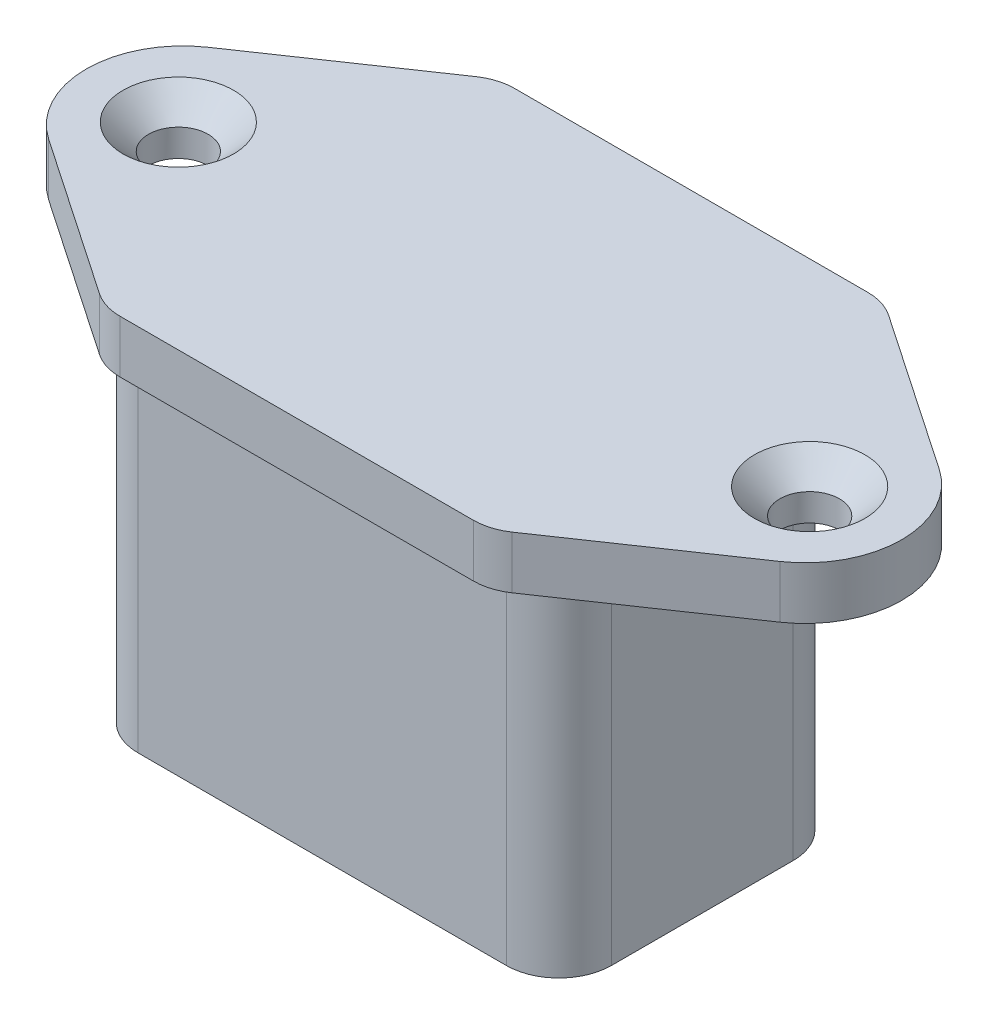
ISO-10303-21;
HEADER;
FILE_DESCRIPTION(('STEP AP214'),'2;1');
FILE_NAME('part.step','',(''),(''),'','','');
FILE_SCHEMA(('AUTOMOTIVE_DESIGN { 1 0 10303 214 1 1 1 1 }'));
ENDSEC;
DATA;
#1=APPLICATION_CONTEXT('core data for automotive mechanical design processes');
#2=APPLICATION_PROTOCOL_DEFINITION('international standard','automotive_design',2000,#1);
#3=PRODUCT_CONTEXT('',#1,'mechanical');
#4=PRODUCT('Part','Part','',(#3));
#5=PRODUCT_RELATED_PRODUCT_CATEGORY('part','',(#4));
#6=PRODUCT_DEFINITION_FORMATION('','',#4);
#7=PRODUCT_DEFINITION_CONTEXT('part definition',#1,'design');
#8=PRODUCT_DEFINITION('design','',#6,#7);
#9=PRODUCT_DEFINITION_SHAPE('','',#8);
#10=(LENGTH_UNIT() NAMED_UNIT(*) SI_UNIT(.MILLI.,.METRE.));
#11=(NAMED_UNIT(*) PLANE_ANGLE_UNIT() SI_UNIT($,.RADIAN.));
#12=(NAMED_UNIT(*) SI_UNIT($,.STERADIAN.) SOLID_ANGLE_UNIT());
#13=UNCERTAINTY_MEASURE_WITH_UNIT(LENGTH_MEASURE(1.E-05),#10,'distance_accuracy_value','');
#14=(GEOMETRIC_REPRESENTATION_CONTEXT(3) GLOBAL_UNCERTAINTY_ASSIGNED_CONTEXT((#13)) GLOBAL_UNIT_ASSIGNED_CONTEXT((#10,
#11,#12)) REPRESENTATION_CONTEXT('',''));
#15=CARTESIAN_POINT('',(0.,0.,0.));
#16=DIRECTION('',(0.,0.,1.));
#17=DIRECTION('',(1.,0.,0.));
#18=AXIS2_PLACEMENT_3D('',#15,#16,#17);
#19=CARTESIAN_POINT('',(17.75,12.75,9.8));
#20=DIRECTION('',(0.,-1.,0.));
#21=DIRECTION('',(0.,0.,-1.));
#22=AXIS2_PLACEMENT_3D('',#19,#20,#21);
#23=PLANE('',#22);
#24=DIRECTION('',(1.,0.,0.));
#25=VECTOR('',#24,1.);
#26=CARTESIAN_POINT('',(-11.,12.75,21.05));
#27=LINE('',#26,#25);
#28=CARTESIAN_POINT('',(-10.0756186418678,12.75,21.05));
#29=VERTEX_POINT('',#28);
#30=CARTESIAN_POINT('',(10.0756186418678,12.75,21.05));
#31=VERTEX_POINT('',#30);
#32=EDGE_CURVE('E418',#29,#31,#27,.T.);
#33=ORIENTED_EDGE('',*,*,#32,.T.);
#34=CARTESIAN_POINT('',(10.0756186418678,12.75,18.05));
#35=DIRECTION('',(0.,-1.,0.));
#36=DIRECTION('',(0.,0.,-1.));
#37=AXIS2_PLACEMENT_3D('',#34,#35,#36);
#38=CIRCLE('',#37,3.);
#39=CARTESIAN_POINT('',(11.76407535747,12.75,20.529740696028));
#40=VERTEX_POINT('',#39);
#41=EDGE_CURVE('E180',#31,#40,#38,.F.);
#42=ORIENTED_EDGE('',*,*,#41,.T.);
#43=DIRECTION('',(0.826580232009344,0.,-0.562818905200757));
#44=VECTOR('',#43,1.);
#45=CARTESIAN_POINT('',(11.,12.75,21.05));
#46=LINE('',#45,#44);
#47=CARTESIAN_POINT('',(20.8455039786042,12.75,14.3461912760514));
#48=VERTEX_POINT('',#47);
#49=EDGE_CURVE('E389',#40,#48,#46,.T.);
#50=ORIENTED_EDGE('',*,*,#49,.T.);
#51=CARTESIAN_POINT('',(17.75,12.75,9.8));
#52=DIRECTION('',(0.,1.,0.));
#53=DIRECTION('',(0.,0.,-1.));
#54=AXIS2_PLACEMENT_3D('',#51,#52,#53);
#55=CIRCLE('',#54,5.5);
#56=CARTESIAN_POINT('',(20.8455039786042,12.75,5.25380872394861));
#57=VERTEX_POINT('',#56);
#58=EDGE_CURVE('E393',#48,#57,#55,.T.);
#59=ORIENTED_EDGE('',*,*,#58,.T.);
#60=DIRECTION('',(-0.826580232009344,0.,-0.562818905200758));
#61=VECTOR('',#60,1.);
#62=CARTESIAN_POINT('',(11.,12.75,-1.45));
#63=LINE('',#62,#61);
#64=CARTESIAN_POINT('',(11.76407535747,12.75,-0.929740696028029));
#65=VERTEX_POINT('',#64);
#66=EDGE_CURVE('E432',#57,#65,#63,.T.);
#67=ORIENTED_EDGE('',*,*,#66,.T.);
#68=CARTESIAN_POINT('',(10.0756186418678,12.75,1.55));
#69=DIRECTION('',(0.,-1.,0.));
#70=DIRECTION('',(0.,0.,-1.));
#71=AXIS2_PLACEMENT_3D('',#68,#69,#70);
#72=CIRCLE('',#71,3.);
#73=CARTESIAN_POINT('',(10.0756186418678,12.75,-1.45));
#74=VERTEX_POINT('',#73);
#75=EDGE_CURVE('E171',#65,#74,#72,.F.);
#76=ORIENTED_EDGE('',*,*,#75,.T.);
#77=DIRECTION('',(-1.,0.,0.));
#78=VECTOR('',#77,1.);
#79=CARTESIAN_POINT('',(-11.,12.75,-1.45));
#80=LINE('',#79,#78);
#81=CARTESIAN_POINT('',(-10.0756186418678,12.75,-1.45));
#82=VERTEX_POINT('',#81);
#83=EDGE_CURVE('E429',#74,#82,#80,.T.);
#84=ORIENTED_EDGE('',*,*,#83,.T.);
#85=CARTESIAN_POINT('',(-10.0756186418678,12.75,1.55));
#86=DIRECTION('',(0.,-1.,0.));
#87=DIRECTION('',(0.,0.,-1.));
#88=AXIS2_PLACEMENT_3D('',#85,#86,#87);
#89=CIRCLE('',#88,3.);
#90=CARTESIAN_POINT('',(-11.76407535747,12.75,-0.929740696028028));
#91=VERTEX_POINT('',#90);
#92=EDGE_CURVE('E174',#82,#91,#89,.F.);
#93=ORIENTED_EDGE('',*,*,#92,.T.);
#94=DIRECTION('',(-0.826580232009344,0.,0.562818905200757));
#95=VECTOR('',#94,1.);
#96=CARTESIAN_POINT('',(-11.,12.75,-1.45));
#97=LINE('',#96,#95);
#98=CARTESIAN_POINT('',(-20.8455039786042,12.75,5.25380872394861));
#99=VERTEX_POINT('',#98);
#100=EDGE_CURVE('E426',#91,#99,#97,.T.);
#101=ORIENTED_EDGE('',*,*,#100,.T.);
#102=CARTESIAN_POINT('',(-17.75,12.75,9.8));
#103=DIRECTION('',(0.,1.,0.));
#104=DIRECTION('',(0.,0.,1.));
#105=AXIS2_PLACEMENT_3D('',#102,#103,#104);
#106=CIRCLE('',#105,5.5);
#107=CARTESIAN_POINT('',(-20.8455039786042,12.75,14.3461912760514));
#108=VERTEX_POINT('',#107);
#109=EDGE_CURVE('E423',#99,#108,#106,.T.);
#110=ORIENTED_EDGE('',*,*,#109,.T.);
#111=DIRECTION('',(0.826580232009344,0.,0.562818905200757));
#112=VECTOR('',#111,1.);
#113=CARTESIAN_POINT('',(-11.,12.75,21.05));
#114=LINE('',#113,#112);
#115=CARTESIAN_POINT('',(-11.76407535747,12.75,20.529740696028));
#116=VERTEX_POINT('',#115);
#117=EDGE_CURVE('E420',#108,#116,#114,.T.);
#118=ORIENTED_EDGE('',*,*,#117,.T.);
#119=CARTESIAN_POINT('',(-10.0756186418678,12.75,18.05));
#120=DIRECTION('',(0.,-1.,0.));
#121=DIRECTION('',(0.,0.,-1.));
#122=AXIS2_PLACEMENT_3D('',#119,#120,#121);
#123=CIRCLE('',#122,3.);
#124=EDGE_CURVE('E177',#116,#29,#123,.F.);
#125=ORIENTED_EDGE('',*,*,#124,.T.);
#126=EDGE_LOOP('',(#33,#42,#50,#59,#67,#76,#84,#93,#101,#110,#118,#125));
#127=FACE_BOUND('',#126,.T.);
#128=CARTESIAN_POINT('',(18.,12.75,9.8));
#129=DIRECTION('',(0.,1.,0.));
#130=DIRECTION('',(0.,0.,1.));
#131=AXIS2_PLACEMENT_3D('',#128,#129,#130);
#132=CIRCLE('',#131,3.15);
#133=CARTESIAN_POINT('',(18.,12.75,12.95));
#134=VERTEX_POINT('',#133);
#135=EDGE_CURVE('E442',#134,#134,#132,.T.);
#136=ORIENTED_EDGE('',*,*,#135,.F.);
#137=EDGE_LOOP('',(#136));
#138=FACE_BOUND('',#137,.T.);
#139=CARTESIAN_POINT('',(-18.,12.75,9.8));
#140=DIRECTION('',(0.,1.,0.));
#141=DIRECTION('',(0.,0.,1.));
#142=AXIS2_PLACEMENT_3D('',#139,#140,#141);
#143=CIRCLE('',#142,3.15);
#144=CARTESIAN_POINT('',(-18.,12.75,12.95));
#145=VERTEX_POINT('',#144);
#146=EDGE_CURVE('E451',#145,#145,#143,.T.);
#147=ORIENTED_EDGE('',*,*,#146,.F.);
#148=EDGE_LOOP('',(#147));
#149=FACE_BOUND('',#148,.T.);
#150=ADVANCED_FACE('F34',(#127,#138,#149),#23,.F.);
#151=CARTESIAN_POINT('',(13.5,-9.75,19.6));
#152=DIRECTION('',(-1.,0.,0.));
#153=DIRECTION('',(0.,0.,1.));
#154=AXIS2_PLACEMENT_3D('',#151,#152,#153);
#155=PLANE('',#154);
#156=DIRECTION('',(0.,0.,-1.));
#157=VECTOR('',#156,1.);
#158=CARTESIAN_POINT('',(13.5,-9.75,19.6));
#159=LINE('',#158,#157);
#160=CARTESIAN_POINT('',(13.5,-9.75,16.6));
#161=VERTEX_POINT('',#160);
#162=CARTESIAN_POINT('',(13.5,-9.75,6.24264068711929));
#163=VERTEX_POINT('',#162);
#164=EDGE_CURVE('E136',#161,#163,#159,.T.);
#165=ORIENTED_EDGE('',*,*,#164,.T.);
#166=DIRECTION('',(0.,1.,0.));
#167=VECTOR('',#166,1.);
#168=CARTESIAN_POINT('',(13.5,9.75,6.24264068711929));
#169=LINE('',#168,#167);
#170=CARTESIAN_POINT('',(13.5,9.75,6.24264068711929));
#171=VERTEX_POINT('',#170);
#172=EDGE_CURVE('E204',#163,#171,#169,.T.);
#173=ORIENTED_EDGE('',*,*,#172,.T.);
#174=DIRECTION('',(0.,0.,-1.));
#175=VECTOR('',#174,1.);
#176=CARTESIAN_POINT('',(13.5,9.75,19.6));
#177=LINE('',#176,#175);
#178=CARTESIAN_POINT('',(13.5,9.75,16.6));
#179=VERTEX_POINT('',#178);
#180=EDGE_CURVE('E138',#179,#171,#177,.T.);
#181=ORIENTED_EDGE('',*,*,#180,.F.);
#182=DIRECTION('',(0.,1.,0.));
#183=VECTOR('',#182,1.);
#184=CARTESIAN_POINT('',(13.5,-9.75,16.6));
#185=LINE('',#184,#183);
#186=EDGE_CURVE('E202',#179,#161,#185,.F.);
#187=ORIENTED_EDGE('',*,*,#186,.T.);
#188=EDGE_LOOP('',(#165,#173,#181,#187));
#189=FACE_BOUND('',#188,.T.);
#190=ADVANCED_FACE('F272',(#189),#155,.F.);
#191=CARTESIAN_POINT('',(-13.5,-9.75,19.6));
#192=DIRECTION('',(1.,0.,0.));
#193=DIRECTION('',(0.,0.,-1.));
#194=AXIS2_PLACEMENT_3D('',#191,#192,#193);
#195=PLANE('',#194);
#196=DIRECTION('',(0.,0.,-1.));
#197=VECTOR('',#196,1.);
#198=CARTESIAN_POINT('',(-13.5,9.75,19.6));
#199=LINE('',#198,#197);
#200=CARTESIAN_POINT('',(-13.5,9.75,16.6));
#201=VERTEX_POINT('',#200);
#202=CARTESIAN_POINT('',(-13.5,9.75,6.24264068711929));
#203=VERTEX_POINT('',#202);
#204=EDGE_CURVE('E130',#201,#203,#199,.T.);
#205=ORIENTED_EDGE('',*,*,#204,.T.);
#206=DIRECTION('',(0.,-1.,0.));
#207=VECTOR('',#206,1.);
#208=CARTESIAN_POINT('',(-13.5,-9.75,6.24264068711929));
#209=LINE('',#208,#207);
#210=CARTESIAN_POINT('',(-13.5,-9.75,6.24264068711929));
#211=VERTEX_POINT('',#210);
#212=EDGE_CURVE('E122',#203,#211,#209,.T.);
#213=ORIENTED_EDGE('',*,*,#212,.T.);
#214=DIRECTION('',(0.,0.,-1.));
#215=VECTOR('',#214,1.);
#216=CARTESIAN_POINT('',(-13.5,-9.75,19.6));
#217=LINE('',#216,#215);
#218=CARTESIAN_POINT('',(-13.5,-9.75,16.6));
#219=VERTEX_POINT('',#218);
#220=EDGE_CURVE('E129',#219,#211,#217,.T.);
#221=ORIENTED_EDGE('',*,*,#220,.F.);
#222=DIRECTION('',(0.,-1.,0.));
#223=VECTOR('',#222,1.);
#224=CARTESIAN_POINT('',(-13.5,-9.75,16.6));
#225=LINE('',#224,#223);
#226=EDGE_CURVE('E65',#219,#201,#225,.F.);
#227=ORIENTED_EDGE('',*,*,#226,.T.);
#228=EDGE_LOOP('',(#205,#213,#221,#227));
#229=FACE_BOUND('',#228,.T.);
#230=ADVANCED_FACE('F128',(#229),#195,.F.);
#231=CARTESIAN_POINT('',(-13.5,-9.75,19.6));
#232=DIRECTION('',(0.,1.,0.));
#233=DIRECTION('',(0.,0.,1.));
#234=AXIS2_PLACEMENT_3D('',#231,#232,#233);
#235=PLANE('',#234);
#236=DIRECTION('',(0.707106781186549,0.,0.707106781186546));
#237=VECTOR('',#236,1.);
#238=CARTESIAN_POINT('',(13.5,-9.75,5.));
#239=LINE('',#238,#237);
#240=CARTESIAN_POINT('',(9.37867965644034,-9.75,0.878679656440353));
#241=VERTEX_POINT('',#240);
#242=CARTESIAN_POINT('',(12.6213203435596,-9.75,4.12132034355964));
#243=VERTEX_POINT('',#242);
#244=EDGE_CURVE('E154',#241,#243,#239,.T.);
#245=ORIENTED_EDGE('',*,*,#244,.T.);
#246=CARTESIAN_POINT('',(10.5,-9.75,6.24264068711929));
#247=DIRECTION('',(0.,1.,0.));
#248=DIRECTION('',(0.,0.,1.));
#249=AXIS2_PLACEMENT_3D('',#246,#247,#248);
#250=CIRCLE('',#249,3.);
#251=EDGE_CURVE('E218',#243,#163,#250,.F.);
#252=ORIENTED_EDGE('',*,*,#251,.T.);
#253=ORIENTED_EDGE('',*,*,#164,.F.);
#254=CARTESIAN_POINT('',(10.5,-9.75,16.6));
#255=DIRECTION('',(0.,1.,0.));
#256=DIRECTION('',(0.,0.,1.));
#257=AXIS2_PLACEMENT_3D('',#254,#255,#256);
#258=CIRCLE('',#257,3.);
#259=CARTESIAN_POINT('',(10.5,-9.75,19.6));
#260=VERTEX_POINT('',#259);
#261=EDGE_CURVE('E212',#161,#260,#258,.F.);
#262=ORIENTED_EDGE('',*,*,#261,.T.);
#263=DIRECTION('',(1.,0.,0.));
#264=VECTOR('',#263,1.);
#265=CARTESIAN_POINT('',(-13.5,-9.75,19.6));
#266=LINE('',#265,#264);
#267=CARTESIAN_POINT('',(-10.5,-9.75,19.6));
#268=VERTEX_POINT('',#267);
#269=EDGE_CURVE('E141',#268,#260,#266,.T.);
#270=ORIENTED_EDGE('',*,*,#269,.F.);
#271=CARTESIAN_POINT('',(-10.5,-9.75,16.6));
#272=DIRECTION('',(0.,1.,0.));
#273=DIRECTION('',(0.,0.,1.));
#274=AXIS2_PLACEMENT_3D('',#271,#272,#273);
#275=CIRCLE('',#274,3.);
#276=EDGE_CURVE('E126',#268,#219,#275,.F.);
#277=ORIENTED_EDGE('',*,*,#276,.T.);
#278=ORIENTED_EDGE('',*,*,#220,.T.);
#279=CARTESIAN_POINT('',(-10.5,-9.75,6.24264068711929));
#280=DIRECTION('',(0.,1.,0.));
#281=DIRECTION('',(0.,0.,1.));
#282=AXIS2_PLACEMENT_3D('',#279,#280,#281);
#283=CIRCLE('',#282,3.);
#284=CARTESIAN_POINT('',(-12.6213203435596,-9.75,4.12132034355964));
#285=VERTEX_POINT('',#284);
#286=EDGE_CURVE('E118',#211,#285,#283,.F.);
#287=ORIENTED_EDGE('',*,*,#286,.T.);
#288=DIRECTION('',(0.707106781186549,0.,-0.707106781186546));
#289=VECTOR('',#288,1.);
#290=CARTESIAN_POINT('',(-13.5,-9.75,5.));
#291=LINE('',#290,#289);
#292=CARTESIAN_POINT('',(-9.37867965644034,-9.75,0.878679656440353));
#293=VERTEX_POINT('',#292);
#294=EDGE_CURVE('E152',#285,#293,#291,.T.);
#295=ORIENTED_EDGE('',*,*,#294,.T.);
#296=CARTESIAN_POINT('',(-7.2573593128807,-9.75,3.));
#297=DIRECTION('',(0.,1.,0.));
#298=DIRECTION('',(0.,0.,1.));
#299=AXIS2_PLACEMENT_3D('',#296,#297,#298);
#300=CIRCLE('',#299,3.);
#301=CARTESIAN_POINT('',(-7.2573593128807,-9.75,0.));
#302=VERTEX_POINT('',#301);
#303=EDGE_CURVE('E125',#293,#302,#300,.F.);
#304=ORIENTED_EDGE('',*,*,#303,.T.);
#305=DIRECTION('',(1.,0.,0.));
#306=VECTOR('',#305,1.);
#307=CARTESIAN_POINT('',(-13.5,-9.75,0.));
#308=LINE('',#307,#306);
#309=CARTESIAN_POINT('',(7.2573593128807,-9.75,0.));
#310=VERTEX_POINT('',#309);
#311=EDGE_CURVE('E259',#302,#310,#308,.T.);
#312=ORIENTED_EDGE('',*,*,#311,.T.);
#313=CARTESIAN_POINT('',(7.2573593128807,-9.75,3.));
#314=DIRECTION('',(0.,1.,0.));
#315=DIRECTION('',(0.,0.,1.));
#316=AXIS2_PLACEMENT_3D('',#313,#314,#315);
#317=CIRCLE('',#316,3.);
#318=EDGE_CURVE('E216',#310,#241,#317,.F.);
#319=ORIENTED_EDGE('',*,*,#318,.T.);
#320=EDGE_LOOP('',(#245,#252,#253,#262,#270,#277,#278,#287,#295,#304,#312,#319));
#321=FACE_BOUND('',#320,.T.);
#322=ADVANCED_FACE('F134',(#321),#235,.F.);
#323=CARTESIAN_POINT('',(0.,0.,19.6));
#324=DIRECTION('',(0.,0.,-1.));
#325=DIRECTION('',(-1.,0.,0.));
#326=AXIS2_PLACEMENT_3D('',#323,#324,#325);
#327=PLANE('',#326);
#328=DIRECTION('',(-1.,0.,0.));
#329=VECTOR('',#328,1.);
#330=CARTESIAN_POINT('',(-13.5,9.75,19.6));
#331=LINE('',#330,#329);
#332=CARTESIAN_POINT('',(10.5,9.75,19.6));
#333=VERTEX_POINT('',#332);
#334=CARTESIAN_POINT('',(-10.5,9.75,19.6));
#335=VERTEX_POINT('',#334);
#336=EDGE_CURVE('E250',#333,#335,#331,.T.);
#337=ORIENTED_EDGE('',*,*,#336,.T.);
#338=DIRECTION('',(0.,-1.,0.));
#339=VECTOR('',#338,1.);
#340=CARTESIAN_POINT('',(-10.5,0.,19.6));
#341=LINE('',#340,#339);
#342=EDGE_CURVE('E231',#335,#268,#341,.T.);
#343=ORIENTED_EDGE('',*,*,#342,.T.);
#344=ORIENTED_EDGE('',*,*,#269,.T.);
#345=DIRECTION('',(0.,1.,0.));
#346=VECTOR('',#345,1.);
#347=CARTESIAN_POINT('',(10.5,0.,19.6));
#348=LINE('',#347,#346);
#349=EDGE_CURVE('E131',#260,#333,#348,.T.);
#350=ORIENTED_EDGE('',*,*,#349,.T.);
#351=EDGE_LOOP('',(#337,#343,#344,#350));
#352=FACE_BOUND('',#351,.T.);
#353=ADVANCED_FACE('F256',(#352),#327,.F.);
#354=CARTESIAN_POINT('',(0.,0.,0.));
#355=DIRECTION('',(0.,0.,-1.));
#356=DIRECTION('',(-1.,0.,0.));
#357=AXIS2_PLACEMENT_3D('',#354,#355,#356);
#358=PLANE('',#357);
#359=DIRECTION('',(-1.,0.,0.));
#360=VECTOR('',#359,1.);
#361=CARTESIAN_POINT('',(-13.5,9.75,0.));
#362=LINE('',#361,#360);
#363=CARTESIAN_POINT('',(7.2573593128807,9.75,0.));
#364=VERTEX_POINT('',#363);
#365=CARTESIAN_POINT('',(-7.2573593128807,9.75,0.));
#366=VERTEX_POINT('',#365);
#367=EDGE_CURVE('E373',#364,#366,#362,.T.);
#368=ORIENTED_EDGE('',*,*,#367,.F.);
#369=DIRECTION('',(0.,-1.,0.));
#370=VECTOR('',#369,1.);
#371=CARTESIAN_POINT('',(7.2573593128807,0.,0.));
#372=LINE('',#371,#370);
#373=EDGE_CURVE('E223',#364,#310,#372,.T.);
#374=ORIENTED_EDGE('',*,*,#373,.T.);
#375=ORIENTED_EDGE('',*,*,#311,.F.);
#376=DIRECTION('',(0.,1.,0.));
#377=VECTOR('',#376,1.);
#378=CARTESIAN_POINT('',(-7.2573593128807,0.,0.));
#379=LINE('',#378,#377);
#380=EDGE_CURVE('E220',#302,#366,#379,.T.);
#381=ORIENTED_EDGE('',*,*,#380,.T.);
#382=EDGE_LOOP('',(#368,#374,#375,#381));
#383=FACE_BOUND('',#382,.T.);
#384=ADVANCED_FACE('F324',(#383),#358,.T.);
#385=CARTESIAN_POINT('',(13.5,-9.75,5.));
#386=DIRECTION('',(0.707106781186546,0.,-0.707106781186549));
#387=DIRECTION('',(0.,-1.,0.));
#388=AXIS2_PLACEMENT_3D('',#385,#386,#387);
#389=PLANE('',#388);
#390=DIRECTION('',(-0.707106781186549,0.,-0.707106781186546));
#391=VECTOR('',#390,1.);
#392=CARTESIAN_POINT('',(13.5,9.75,5.));
#393=LINE('',#392,#391);
#394=CARTESIAN_POINT('',(12.6213203435596,9.75,4.12132034355964));
#395=VERTEX_POINT('',#394);
#396=CARTESIAN_POINT('',(9.37867965644034,9.75,0.878679656440353));
#397=VERTEX_POINT('',#396);
#398=EDGE_CURVE('E149',#395,#397,#393,.T.);
#399=ORIENTED_EDGE('',*,*,#398,.F.);
#400=DIRECTION('',(0.,1.,0.));
#401=VECTOR('',#400,1.);
#402=CARTESIAN_POINT('',(12.6213203435596,-9.75,4.12132034355964));
#403=LINE('',#402,#401);
#404=EDGE_CURVE('E210',#395,#243,#403,.F.);
#405=ORIENTED_EDGE('',*,*,#404,.T.);
#406=ORIENTED_EDGE('',*,*,#244,.F.);
#407=DIRECTION('',(0.,-1.,0.));
#408=VECTOR('',#407,1.);
#409=CARTESIAN_POINT('',(9.37867965644034,-9.75,0.878679656440354));
#410=LINE('',#409,#408);
#411=EDGE_CURVE('E207',#241,#397,#410,.F.);
#412=ORIENTED_EDGE('',*,*,#411,.T.);
#413=EDGE_LOOP('',(#399,#405,#406,#412));
#414=FACE_BOUND('',#413,.T.);
#415=ADVANCED_FACE('F327',(#414),#389,.T.);
#416=CARTESIAN_POINT('',(-13.5,-9.75,5.));
#417=DIRECTION('',(-0.707106781186546,0.,-0.707106781186549));
#418=DIRECTION('',(0.,1.,0.));
#419=AXIS2_PLACEMENT_3D('',#416,#417,#418);
#420=PLANE('',#419);
#421=DIRECTION('',(-0.707106781186549,0.,0.707106781186546));
#422=VECTOR('',#421,1.);
#423=CARTESIAN_POINT('',(-13.5,9.75,5.));
#424=LINE('',#423,#422);
#425=CARTESIAN_POINT('',(-9.37867965644034,9.75,0.878679656440353));
#426=VERTEX_POINT('',#425);
#427=CARTESIAN_POINT('',(-12.6213203435596,9.75,4.12132034355964));
#428=VERTEX_POINT('',#427);
#429=EDGE_CURVE('E147',#426,#428,#424,.T.);
#430=ORIENTED_EDGE('',*,*,#429,.F.);
#431=DIRECTION('',(0.,1.,0.));
#432=VECTOR('',#431,1.);
#433=CARTESIAN_POINT('',(-9.37867965644034,-9.75,0.878679656440354));
#434=LINE('',#433,#432);
#435=EDGE_CURVE('E51',#426,#293,#434,.F.);
#436=ORIENTED_EDGE('',*,*,#435,.T.);
#437=ORIENTED_EDGE('',*,*,#294,.F.);
#438=DIRECTION('',(0.,-1.,0.));
#439=VECTOR('',#438,1.);
#440=CARTESIAN_POINT('',(-12.6213203435596,9.75,4.12132034355964));
#441=LINE('',#440,#439);
#442=EDGE_CURVE('E74',#285,#428,#441,.F.);
#443=ORIENTED_EDGE('',*,*,#442,.T.);
#444=EDGE_LOOP('',(#430,#436,#437,#443));
#445=FACE_BOUND('',#444,.T.);
#446=ADVANCED_FACE('F320',(#445),#420,.T.);
#447=CARTESIAN_POINT('',(17.75,12.75,9.8));
#448=DIRECTION('',(0.,-1.,0.));
#449=DIRECTION('',(0.,0.,-1.));
#450=AXIS2_PLACEMENT_3D('',#447,#448,#449);
#451=CYLINDRICAL_SURFACE('',#450,5.5);
#452=CARTESIAN_POINT('',(17.75,9.75,9.8));
#453=DIRECTION('',(0.,1.,0.));
#454=DIRECTION('',(0.,0.,-1.));
#455=AXIS2_PLACEMENT_3D('',#452,#453,#454);
#456=CIRCLE('',#455,5.5);
#457=CARTESIAN_POINT('',(20.8455039786042,9.75,14.3461912760514));
#458=VERTEX_POINT('',#457);
#459=CARTESIAN_POINT('',(20.8455039786042,9.75,5.25380872394861));
#460=VERTEX_POINT('',#459);
#461=EDGE_CURVE('E412',#458,#460,#456,.T.);
#462=ORIENTED_EDGE('',*,*,#461,.T.);
#463=DIRECTION('',(0.,-1.,0.));
#464=VECTOR('',#463,1.);
#465=CARTESIAN_POINT('',(20.8455039786042,12.75,5.25380872394861));
#466=LINE('',#465,#464);
#467=EDGE_CURVE('E374',#57,#460,#466,.T.);
#468=ORIENTED_EDGE('',*,*,#467,.F.);
#469=ORIENTED_EDGE('',*,*,#58,.F.);
#470=DIRECTION('',(0.,-1.,0.));
#471=VECTOR('',#470,1.);
#472=CARTESIAN_POINT('',(20.8455039786042,12.75,14.3461912760514));
#473=LINE('',#472,#471);
#474=EDGE_CURVE('E386',#48,#458,#473,.T.);
#475=ORIENTED_EDGE('',*,*,#474,.T.);
#476=EDGE_LOOP('',(#462,#468,#469,#475));
#477=FACE_BOUND('',#476,.T.);
#478=ADVANCED_FACE('F316',(#477),#451,.T.);
#479=CARTESIAN_POINT('',(11.,12.75,-1.45));
#480=DIRECTION('',(-0.562818905200757,0.,0.826580232009344));
#481=DIRECTION('',(0.826580232009344,0.,0.562818905200758));
#482=AXIS2_PLACEMENT_3D('',#479,#480,#481);
#483=PLANE('',#482);
#484=DIRECTION('',(-0.826580232009344,0.,-0.562818905200758));
#485=VECTOR('',#484,1.);
#486=CARTESIAN_POINT('',(11.,9.75,-1.45));
#487=LINE('',#486,#485);
#488=CARTESIAN_POINT('',(11.76407535747,9.75,-0.929740696028029));
#489=VERTEX_POINT('',#488);
#490=EDGE_CURVE('E409',#460,#489,#487,.T.);
#491=ORIENTED_EDGE('',*,*,#490,.T.);
#492=DIRECTION('',(0.,-1.,0.));
#493=VECTOR('',#492,1.);
#494=CARTESIAN_POINT('',(11.76407535747,12.75,-0.929740696028029));
#495=LINE('',#494,#493);
#496=EDGE_CURVE('E199',#489,#65,#495,.F.);
#497=ORIENTED_EDGE('',*,*,#496,.T.);
#498=ORIENTED_EDGE('',*,*,#66,.F.);
#499=ORIENTED_EDGE('',*,*,#467,.T.);
#500=EDGE_LOOP('',(#491,#497,#498,#499));
#501=FACE_BOUND('',#500,.T.);
#502=ADVANCED_FACE('F312',(#501),#483,.F.);
#503=CARTESIAN_POINT('',(-11.,12.75,-1.45));
#504=DIRECTION('',(0.,0.,1.));
#505=DIRECTION('',(1.,0.,0.));
#506=AXIS2_PLACEMENT_3D('',#503,#504,#505);
#507=PLANE('',#506);
#508=DIRECTION('',(-1.,0.,0.));
#509=VECTOR('',#508,1.);
#510=CARTESIAN_POINT('',(-11.,9.75,-1.45));
#511=LINE('',#510,#509);
#512=CARTESIAN_POINT('',(10.0756186418678,9.75,-1.45));
#513=VERTEX_POINT('',#512);
#514=CARTESIAN_POINT('',(-10.0756186418678,9.75,-1.45));
#515=VERTEX_POINT('',#514);
#516=EDGE_CURVE('E406',#513,#515,#511,.T.);
#517=ORIENTED_EDGE('',*,*,#516,.T.);
#518=DIRECTION('',(0.,-1.,0.));
#519=VECTOR('',#518,1.);
#520=CARTESIAN_POINT('',(-10.0756186418678,12.75,-1.45));
#521=LINE('',#520,#519);
#522=EDGE_CURVE('E196',#515,#82,#521,.F.);
#523=ORIENTED_EDGE('',*,*,#522,.T.);
#524=ORIENTED_EDGE('',*,*,#83,.F.);
#525=DIRECTION('',(0.,-1.,0.));
#526=VECTOR('',#525,1.);
#527=CARTESIAN_POINT('',(10.0756186418678,12.75,-1.45));
#528=LINE('',#527,#526);
#529=EDGE_CURVE('E193',#74,#513,#528,.T.);
#530=ORIENTED_EDGE('',*,*,#529,.T.);
#531=EDGE_LOOP('',(#517,#523,#524,#530));
#532=FACE_BOUND('',#531,.T.);
#533=ADVANCED_FACE('F308',(#532),#507,.F.);
#534=CARTESIAN_POINT('',(-11.,12.75,-1.45));
#535=DIRECTION('',(0.562818905200757,0.,0.826580232009344));
#536=DIRECTION('',(0.826580232009344,0.,-0.562818905200757));
#537=AXIS2_PLACEMENT_3D('',#534,#535,#536);
#538=PLANE('',#537);
#539=ORIENTED_EDGE('',*,*,#100,.F.);
#540=DIRECTION('',(0.,-1.,0.));
#541=VECTOR('',#540,1.);
#542=CARTESIAN_POINT('',(-11.76407535747,12.75,-0.929740696028028));
#543=LINE('',#542,#541);
#544=CARTESIAN_POINT('',(-11.76407535747,9.75,-0.929740696028028));
#545=VERTEX_POINT('',#544);
#546=EDGE_CURVE('E186',#91,#545,#543,.T.);
#547=ORIENTED_EDGE('',*,*,#546,.T.);
#548=DIRECTION('',(-0.826580232009344,0.,0.562818905200757));
#549=VECTOR('',#548,1.);
#550=CARTESIAN_POINT('',(-11.,9.75,-1.45));
#551=LINE('',#550,#549);
#552=CARTESIAN_POINT('',(-20.8455039786042,9.75,5.25380872394861));
#553=VERTEX_POINT('',#552);
#554=EDGE_CURVE('E403',#545,#553,#551,.T.);
#555=ORIENTED_EDGE('',*,*,#554,.T.);
#556=DIRECTION('',(0.,-1.,0.));
#557=VECTOR('',#556,1.);
#558=CARTESIAN_POINT('',(-20.8455039786042,12.75,5.25380872394861));
#559=LINE('',#558,#557);
#560=EDGE_CURVE('E380',#99,#553,#559,.T.);
#561=ORIENTED_EDGE('',*,*,#560,.F.);
#562=EDGE_LOOP('',(#539,#547,#555,#561));
#563=FACE_BOUND('',#562,.T.);
#564=ADVANCED_FACE('F304',(#563),#538,.F.);
#565=CARTESIAN_POINT('',(-17.75,12.75,9.8));
#566=DIRECTION('',(0.,-1.,0.));
#567=DIRECTION('',(0.,0.,-1.));
#568=AXIS2_PLACEMENT_3D('',#565,#566,#567);
#569=CYLINDRICAL_SURFACE('',#568,5.5);
#570=CARTESIAN_POINT('',(-17.75,9.75,9.8));
#571=DIRECTION('',(0.,1.,0.));
#572=DIRECTION('',(0.,0.,1.));
#573=AXIS2_PLACEMENT_3D('',#570,#571,#572);
#574=CIRCLE('',#573,5.5);
#575=CARTESIAN_POINT('',(-20.8455039786042,9.75,14.3461912760514));
#576=VERTEX_POINT('',#575);
#577=EDGE_CURVE('E400',#553,#576,#574,.T.);
#578=ORIENTED_EDGE('',*,*,#577,.T.);
#579=DIRECTION('',(0.,-1.,0.));
#580=VECTOR('',#579,1.);
#581=CARTESIAN_POINT('',(-20.8455039786042,12.75,14.3461912760514));
#582=LINE('',#581,#580);
#583=EDGE_CURVE('E383',#108,#576,#582,.T.);
#584=ORIENTED_EDGE('',*,*,#583,.F.);
#585=ORIENTED_EDGE('',*,*,#109,.F.);
#586=ORIENTED_EDGE('',*,*,#560,.T.);
#587=EDGE_LOOP('',(#578,#584,#585,#586));
#588=FACE_BOUND('',#587,.T.);
#589=ADVANCED_FACE('F300',(#588),#569,.T.);
#590=CARTESIAN_POINT('',(-11.,12.75,21.05));
#591=DIRECTION('',(0.562818905200757,0.,-0.826580232009344));
#592=DIRECTION('',(-0.826580232009344,0.,-0.562818905200757));
#593=AXIS2_PLACEMENT_3D('',#590,#591,#592);
#594=PLANE('',#593);
#595=DIRECTION('',(0.826580232009344,0.,0.562818905200757));
#596=VECTOR('',#595,1.);
#597=CARTESIAN_POINT('',(-11.,9.75,21.05));
#598=LINE('',#597,#596);
#599=CARTESIAN_POINT('',(-11.76407535747,9.75,20.529740696028));
#600=VERTEX_POINT('',#599);
#601=EDGE_CURVE('E397',#576,#600,#598,.T.);
#602=ORIENTED_EDGE('',*,*,#601,.T.);
#603=DIRECTION('',(0.,-1.,0.));
#604=VECTOR('',#603,1.);
#605=CARTESIAN_POINT('',(-11.76407535747,12.75,20.529740696028));
#606=LINE('',#605,#604);
#607=EDGE_CURVE('E183',#600,#116,#606,.F.);
#608=ORIENTED_EDGE('',*,*,#607,.T.);
#609=ORIENTED_EDGE('',*,*,#117,.F.);
#610=ORIENTED_EDGE('',*,*,#583,.T.);
#611=EDGE_LOOP('',(#602,#608,#609,#610));
#612=FACE_BOUND('',#611,.T.);
#613=ADVANCED_FACE('F296',(#612),#594,.F.);
#614=CARTESIAN_POINT('',(-11.,12.75,21.05));
#615=DIRECTION('',(0.,0.,-1.));
#616=DIRECTION('',(-1.,0.,0.));
#617=AXIS2_PLACEMENT_3D('',#614,#615,#616);
#618=PLANE('',#617);
#619=DIRECTION('',(1.,0.,0.));
#620=VECTOR('',#619,1.);
#621=CARTESIAN_POINT('',(-11.,9.75,21.05));
#622=LINE('',#621,#620);
#623=CARTESIAN_POINT('',(-10.0756186418678,9.75,21.05));
#624=VERTEX_POINT('',#623);
#625=CARTESIAN_POINT('',(10.0756186418678,9.75,21.05));
#626=VERTEX_POINT('',#625);
#627=EDGE_CURVE('E394',#624,#626,#622,.T.);
#628=ORIENTED_EDGE('',*,*,#627,.T.);
#629=DIRECTION('',(0.,-1.,0.));
#630=VECTOR('',#629,1.);
#631=CARTESIAN_POINT('',(10.0756186418678,12.75,21.05));
#632=LINE('',#631,#630);
#633=EDGE_CURVE('E168',#626,#31,#632,.F.);
#634=ORIENTED_EDGE('',*,*,#633,.T.);
#635=ORIENTED_EDGE('',*,*,#32,.F.);
#636=DIRECTION('',(0.,-1.,0.));
#637=VECTOR('',#636,1.);
#638=CARTESIAN_POINT('',(-10.0756186418678,12.75,21.05));
#639=LINE('',#638,#637);
#640=EDGE_CURVE('E165',#29,#624,#639,.T.);
#641=ORIENTED_EDGE('',*,*,#640,.T.);
#642=EDGE_LOOP('',(#628,#634,#635,#641));
#643=FACE_BOUND('',#642,.T.);
#644=ADVANCED_FACE('F292',(#643),#618,.F.);
#645=CARTESIAN_POINT('',(11.,12.75,21.05));
#646=DIRECTION('',(-0.562818905200757,0.,-0.826580232009344));
#647=DIRECTION('',(-0.826580232009344,0.,0.562818905200757));
#648=AXIS2_PLACEMENT_3D('',#645,#646,#647);
#649=PLANE('',#648);
#650=ORIENTED_EDGE('',*,*,#49,.F.);
#651=DIRECTION('',(0.,-1.,0.));
#652=VECTOR('',#651,1.);
#653=CARTESIAN_POINT('',(11.76407535747,12.75,20.529740696028));
#654=LINE('',#653,#652);
#655=CARTESIAN_POINT('',(11.76407535747,9.75,20.529740696028));
#656=VERTEX_POINT('',#655);
#657=EDGE_CURVE('E156',#40,#656,#654,.T.);
#658=ORIENTED_EDGE('',*,*,#657,.T.);
#659=DIRECTION('',(0.826580232009344,0.,-0.562818905200757));
#660=VECTOR('',#659,1.);
#661=CARTESIAN_POINT('',(11.,9.75,21.05));
#662=LINE('',#661,#660);
#663=EDGE_CURVE('E390',#656,#458,#662,.T.);
#664=ORIENTED_EDGE('',*,*,#663,.T.);
#665=ORIENTED_EDGE('',*,*,#474,.F.);
#666=EDGE_LOOP('',(#650,#658,#664,#665));
#667=FACE_BOUND('',#666,.T.);
#668=ADVANCED_FACE('F288',(#667),#649,.F.);
#669=CARTESIAN_POINT('',(17.75,9.75,9.8));
#670=DIRECTION('',(0.,-1.,0.));
#671=DIRECTION('',(0.,0.,-1.));
#672=AXIS2_PLACEMENT_3D('',#669,#670,#671);
#673=PLANE('',#672);
#674=CARTESIAN_POINT('',(-18.,9.75,9.8));
#675=DIRECTION('',(0.,-1.,0.));
#676=DIRECTION('',(0.,0.,-1.));
#677=AXIS2_PLACEMENT_3D('',#674,#675,#676);
#678=CIRCLE('',#677,1.7);
#679=CARTESIAN_POINT('',(-18.,9.75,8.1));
#680=VERTEX_POINT('',#679);
#681=EDGE_CURVE('E445',#680,#680,#678,.T.);
#682=ORIENTED_EDGE('',*,*,#681,.F.);
#683=EDGE_LOOP('',(#682));
#684=FACE_BOUND('',#683,.T.);
#685=CARTESIAN_POINT('',(18.,9.75,9.8));
#686=DIRECTION('',(0.,-1.,0.));
#687=DIRECTION('',(0.,0.,-1.));
#688=AXIS2_PLACEMENT_3D('',#685,#686,#687);
#689=CIRCLE('',#688,1.7);
#690=CARTESIAN_POINT('',(18.,9.75,8.1));
#691=VERTEX_POINT('',#690);
#692=EDGE_CURVE('E415',#691,#691,#689,.T.);
#693=ORIENTED_EDGE('',*,*,#692,.F.);
#694=EDGE_LOOP('',(#693));
#695=FACE_BOUND('',#694,.T.);
#696=ORIENTED_EDGE('',*,*,#663,.F.);
#697=CARTESIAN_POINT('',(10.0756186418678,9.75,18.05));
#698=DIRECTION('',(0.,-1.,0.));
#699=DIRECTION('',(0.,0.,-1.));
#700=AXIS2_PLACEMENT_3D('',#697,#698,#699);
#701=CIRCLE('',#700,3.);
#702=EDGE_CURVE('E162',#656,#626,#701,.T.);
#703=ORIENTED_EDGE('',*,*,#702,.T.);
#704=ORIENTED_EDGE('',*,*,#627,.F.);
#705=CARTESIAN_POINT('',(-10.0756186418678,9.75,18.05));
#706=DIRECTION('',(0.,-1.,0.));
#707=DIRECTION('',(0.,0.,-1.));
#708=AXIS2_PLACEMENT_3D('',#705,#706,#707);
#709=CIRCLE('',#708,3.);
#710=EDGE_CURVE('E159',#624,#600,#709,.T.);
#711=ORIENTED_EDGE('',*,*,#710,.T.);
#712=ORIENTED_EDGE('',*,*,#601,.F.);
#713=ORIENTED_EDGE('',*,*,#577,.F.);
#714=ORIENTED_EDGE('',*,*,#554,.F.);
#715=CARTESIAN_POINT('',(-10.0756186418678,9.75,1.55));
#716=DIRECTION('',(0.,-1.,0.));
#717=DIRECTION('',(0.,0.,-1.));
#718=AXIS2_PLACEMENT_3D('',#715,#716,#717);
#719=CIRCLE('',#718,3.);
#720=EDGE_CURVE('E191',#545,#515,#719,.T.);
#721=ORIENTED_EDGE('',*,*,#720,.T.);
#722=ORIENTED_EDGE('',*,*,#516,.F.);
#723=CARTESIAN_POINT('',(10.0756186418678,9.75,1.55));
#724=DIRECTION('',(0.,-1.,0.));
#725=DIRECTION('',(0.,0.,-1.));
#726=AXIS2_PLACEMENT_3D('',#723,#724,#725);
#727=CIRCLE('',#726,3.);
#728=EDGE_CURVE('E189',#513,#489,#727,.T.);
#729=ORIENTED_EDGE('',*,*,#728,.T.);
#730=ORIENTED_EDGE('',*,*,#490,.F.);
#731=ORIENTED_EDGE('',*,*,#461,.F.);
#732=EDGE_LOOP('',(#696,#703,#704,#711,#712,#713,#714,#721,#722,#729,#730,#731));
#733=FACE_BOUND('',#732,.T.);
#734=ORIENTED_EDGE('',*,*,#336,.F.);
#735=CARTESIAN_POINT('',(10.5,9.75,16.6));
#736=DIRECTION('',(0.,-1.,0.));
#737=DIRECTION('',(0.,0.,-1.));
#738=AXIS2_PLACEMENT_3D('',#735,#736,#737);
#739=CIRCLE('',#738,3.);
#740=EDGE_CURVE('E11',#333,#179,#739,.F.);
#741=ORIENTED_EDGE('',*,*,#740,.T.);
#742=ORIENTED_EDGE('',*,*,#180,.T.);
#743=CARTESIAN_POINT('',(10.5,9.75,6.24264068711929));
#744=DIRECTION('',(0.,-1.,0.));
#745=DIRECTION('',(0.,0.,-1.));
#746=AXIS2_PLACEMENT_3D('',#743,#744,#745);
#747=CIRCLE('',#746,3.);
#748=EDGE_CURVE('E234',#171,#395,#747,.F.);
#749=ORIENTED_EDGE('',*,*,#748,.T.);
#750=ORIENTED_EDGE('',*,*,#398,.T.);
#751=CARTESIAN_POINT('',(7.2573593128807,9.75,3.));
#752=DIRECTION('',(0.,-1.,0.));
#753=DIRECTION('',(0.,0.,-1.));
#754=AXIS2_PLACEMENT_3D('',#751,#752,#753);
#755=CIRCLE('',#754,3.);
#756=EDGE_CURVE('E237',#397,#364,#755,.F.);
#757=ORIENTED_EDGE('',*,*,#756,.T.);
#758=ORIENTED_EDGE('',*,*,#367,.T.);
#759=CARTESIAN_POINT('',(-7.2573593128807,9.75,3.));
#760=DIRECTION('',(0.,-1.,0.));
#761=DIRECTION('',(0.,0.,-1.));
#762=AXIS2_PLACEMENT_3D('',#759,#760,#761);
#763=CIRCLE('',#762,3.);
#764=EDGE_CURVE('E240',#366,#426,#763,.F.);
#765=ORIENTED_EDGE('',*,*,#764,.T.);
#766=ORIENTED_EDGE('',*,*,#429,.T.);
#767=CARTESIAN_POINT('',(-10.5,9.75,6.24264068711929));
#768=DIRECTION('',(0.,-1.,0.));
#769=DIRECTION('',(0.,0.,-1.));
#770=AXIS2_PLACEMENT_3D('',#767,#768,#769);
#771=CIRCLE('',#770,3.);
#772=EDGE_CURVE('E242',#428,#203,#771,.F.);
#773=ORIENTED_EDGE('',*,*,#772,.T.);
#774=ORIENTED_EDGE('',*,*,#204,.F.);
#775=CARTESIAN_POINT('',(-10.5,9.75,16.6));
#776=DIRECTION('',(0.,-1.,0.));
#777=DIRECTION('',(0.,0.,-1.));
#778=AXIS2_PLACEMENT_3D('',#775,#776,#777);
#779=CIRCLE('',#778,3.);
#780=EDGE_CURVE('E43',#201,#335,#779,.F.);
#781=ORIENTED_EDGE('',*,*,#780,.T.);
#782=EDGE_LOOP('',(#734,#741,#742,#749,#750,#757,#758,#765,#766,#773,#774,#781));
#783=FACE_BOUND('',#782,.T.);
#784=ADVANCED_FACE('F249',(#684,#695,#733,#783),#673,.T.);
#785=CARTESIAN_POINT('',(10.0756186418678,12.75,18.05));
#786=DIRECTION('',(0.,-1.,0.));
#787=DIRECTION('',(0.,0.,-1.));
#788=AXIS2_PLACEMENT_3D('',#785,#786,#787);
#789=CYLINDRICAL_SURFACE('',#788,3.);
#790=ORIENTED_EDGE('',*,*,#41,.F.);
#791=ORIENTED_EDGE('',*,*,#633,.F.);
#792=ORIENTED_EDGE('',*,*,#702,.F.);
#793=ORIENTED_EDGE('',*,*,#657,.F.);
#794=EDGE_LOOP('',(#790,#791,#792,#793));
#795=FACE_BOUND('',#794,.T.);
#796=ADVANCED_FACE('F287',(#795),#789,.T.);
#797=CARTESIAN_POINT('',(-10.0756186418678,12.75,18.05));
#798=DIRECTION('',(0.,-1.,0.));
#799=DIRECTION('',(0.,0.,-1.));
#800=AXIS2_PLACEMENT_3D('',#797,#798,#799);
#801=CYLINDRICAL_SURFACE('',#800,3.);
#802=ORIENTED_EDGE('',*,*,#124,.F.);
#803=ORIENTED_EDGE('',*,*,#607,.F.);
#804=ORIENTED_EDGE('',*,*,#710,.F.);
#805=ORIENTED_EDGE('',*,*,#640,.F.);
#806=EDGE_LOOP('',(#802,#803,#804,#805));
#807=FACE_BOUND('',#806,.T.);
#808=ADVANCED_FACE('F340',(#807),#801,.T.);
#809=CARTESIAN_POINT('',(-10.0756186418678,12.75,1.55));
#810=DIRECTION('',(0.,-1.,0.));
#811=DIRECTION('',(0.,0.,-1.));
#812=AXIS2_PLACEMENT_3D('',#809,#810,#811);
#813=CYLINDRICAL_SURFACE('',#812,3.);
#814=ORIENTED_EDGE('',*,*,#92,.F.);
#815=ORIENTED_EDGE('',*,*,#522,.F.);
#816=ORIENTED_EDGE('',*,*,#720,.F.);
#817=ORIENTED_EDGE('',*,*,#546,.F.);
#818=EDGE_LOOP('',(#814,#815,#816,#817));
#819=FACE_BOUND('',#818,.T.);
#820=ADVANCED_FACE('F344',(#819),#813,.T.);
#821=CARTESIAN_POINT('',(10.0756186418678,12.75,1.55));
#822=DIRECTION('',(0.,-1.,0.));
#823=DIRECTION('',(0.,0.,-1.));
#824=AXIS2_PLACEMENT_3D('',#821,#822,#823);
#825=CYLINDRICAL_SURFACE('',#824,3.);
#826=ORIENTED_EDGE('',*,*,#75,.F.);
#827=ORIENTED_EDGE('',*,*,#496,.F.);
#828=ORIENTED_EDGE('',*,*,#728,.F.);
#829=ORIENTED_EDGE('',*,*,#529,.F.);
#830=EDGE_LOOP('',(#826,#827,#828,#829));
#831=FACE_BOUND('',#830,.T.);
#832=ADVANCED_FACE('F348',(#831),#825,.T.);
#833=CARTESIAN_POINT('',(10.5,-9.75,6.24264068711929));
#834=DIRECTION('',(0.,-1.,0.));
#835=DIRECTION('',(0.,0.,-1.));
#836=AXIS2_PLACEMENT_3D('',#833,#834,#835);
#837=CYLINDRICAL_SURFACE('',#836,3.);
#838=ORIENTED_EDGE('',*,*,#251,.F.);
#839=ORIENTED_EDGE('',*,*,#404,.F.);
#840=ORIENTED_EDGE('',*,*,#748,.F.);
#841=ORIENTED_EDGE('',*,*,#172,.F.);
#842=EDGE_LOOP('',(#838,#839,#840,#841));
#843=FACE_BOUND('',#842,.T.);
#844=ADVANCED_FACE('F352',(#843),#837,.T.);
#845=CARTESIAN_POINT('',(7.2573593128807,0.,3.));
#846=DIRECTION('',(0.,-1.,0.));
#847=DIRECTION('',(0.,0.,-1.));
#848=AXIS2_PLACEMENT_3D('',#845,#846,#847);
#849=CYLINDRICAL_SURFACE('',#848,3.);
#850=ORIENTED_EDGE('',*,*,#756,.F.);
#851=ORIENTED_EDGE('',*,*,#411,.F.);
#852=ORIENTED_EDGE('',*,*,#318,.F.);
#853=ORIENTED_EDGE('',*,*,#373,.F.);
#854=EDGE_LOOP('',(#850,#851,#852,#853));
#855=FACE_BOUND('',#854,.T.);
#856=ADVANCED_FACE('F356',(#855),#849,.T.);
#857=CARTESIAN_POINT('',(-7.2573593128807,0.,3.));
#858=DIRECTION('',(0.,1.,0.));
#859=DIRECTION('',(0.,0.,1.));
#860=AXIS2_PLACEMENT_3D('',#857,#858,#859);
#861=CYLINDRICAL_SURFACE('',#860,3.);
#862=ORIENTED_EDGE('',*,*,#303,.F.);
#863=ORIENTED_EDGE('',*,*,#435,.F.);
#864=ORIENTED_EDGE('',*,*,#764,.F.);
#865=ORIENTED_EDGE('',*,*,#380,.F.);
#866=EDGE_LOOP('',(#862,#863,#864,#865));
#867=FACE_BOUND('',#866,.T.);
#868=ADVANCED_FACE('F269',(#867),#861,.T.);
#869=CARTESIAN_POINT('',(-10.5,-9.75,6.24264068711929));
#870=DIRECTION('',(0.,1.,0.));
#871=DIRECTION('',(0.,0.,1.));
#872=AXIS2_PLACEMENT_3D('',#869,#870,#871);
#873=CYLINDRICAL_SURFACE('',#872,3.);
#874=ORIENTED_EDGE('',*,*,#772,.F.);
#875=ORIENTED_EDGE('',*,*,#442,.F.);
#876=ORIENTED_EDGE('',*,*,#286,.F.);
#877=ORIENTED_EDGE('',*,*,#212,.F.);
#878=EDGE_LOOP('',(#874,#875,#876,#877));
#879=FACE_BOUND('',#878,.T.);
#880=ADVANCED_FACE('F121',(#879),#873,.T.);
#881=CARTESIAN_POINT('',(-10.5,0.,16.6));
#882=DIRECTION('',(0.,-1.,0.));
#883=DIRECTION('',(0.,0.,-1.));
#884=AXIS2_PLACEMENT_3D('',#881,#882,#883);
#885=CYLINDRICAL_SURFACE('',#884,3.);
#886=ORIENTED_EDGE('',*,*,#780,.F.);
#887=ORIENTED_EDGE('',*,*,#226,.F.);
#888=ORIENTED_EDGE('',*,*,#276,.F.);
#889=ORIENTED_EDGE('',*,*,#342,.F.);
#890=EDGE_LOOP('',(#886,#887,#888,#889));
#891=FACE_BOUND('',#890,.T.);
#892=ADVANCED_FACE('F261',(#891),#885,.T.);
#893=CARTESIAN_POINT('',(10.5,0.,16.6));
#894=DIRECTION('',(0.,1.,0.));
#895=DIRECTION('',(0.,0.,1.));
#896=AXIS2_PLACEMENT_3D('',#893,#894,#895);
#897=CYLINDRICAL_SURFACE('',#896,3.);
#898=ORIENTED_EDGE('',*,*,#261,.F.);
#899=ORIENTED_EDGE('',*,*,#186,.F.);
#900=ORIENTED_EDGE('',*,*,#740,.F.);
#901=ORIENTED_EDGE('',*,*,#349,.F.);
#902=EDGE_LOOP('',(#898,#899,#900,#901));
#903=FACE_BOUND('',#902,.T.);
#904=ADVANCED_FACE('F36',(#903),#897,.T.);
#905=CARTESIAN_POINT('',(18.,12.75,9.8));
#906=DIRECTION('',(0.,1.,0.));
#907=DIRECTION('',(0.,0.,1.));
#908=AXIS2_PLACEMENT_3D('',#905,#906,#907);
#909=CYLINDRICAL_SURFACE('',#908,1.7);
#910=CARTESIAN_POINT('',(18.,11.3,9.8));
#911=DIRECTION('',(0.,1.,0.));
#912=DIRECTION('',(0.,0.,1.));
#913=AXIS2_PLACEMENT_3D('',#910,#911,#912);
#914=CIRCLE('',#913,1.7);
#915=CARTESIAN_POINT('',(18.,11.3,11.5));
#916=VERTEX_POINT('',#915);
#917=EDGE_CURVE('E439',#916,#916,#914,.T.);
#918=ORIENTED_EDGE('',*,*,#917,.T.);
#919=EDGE_LOOP('',(#918));
#920=FACE_BOUND('',#919,.T.);
#921=ORIENTED_EDGE('',*,*,#692,.T.);
#922=EDGE_LOOP('',(#921));
#923=FACE_BOUND('',#922,.T.);
#924=ADVANCED_FACE('F267',(#920,#923),#909,.F.);
#925=CARTESIAN_POINT('',(18.,12.75,9.8));
#926=DIRECTION('',(0.,1.,0.));
#927=DIRECTION('',(0.,0.,1.));
#928=AXIS2_PLACEMENT_3D('',#925,#926,#927);
#929=CONICAL_SURFACE('',#928,3.15,0.785398163397447);
#930=ORIENTED_EDGE('',*,*,#917,.F.);
#931=EDGE_LOOP('',(#930));
#932=FACE_BOUND('',#931,.T.);
#933=ORIENTED_EDGE('',*,*,#135,.T.);
#934=EDGE_LOOP('',(#933));
#935=FACE_BOUND('',#934,.T.);
#936=ADVANCED_FACE('F464',(#932,#935),#929,.F.);
#937=CARTESIAN_POINT('',(-18.,12.75,9.8));
#938=DIRECTION('',(0.,1.,0.));
#939=DIRECTION('',(0.,0.,1.));
#940=AXIS2_PLACEMENT_3D('',#937,#938,#939);
#941=CYLINDRICAL_SURFACE('',#940,1.7);
#942=CARTESIAN_POINT('',(-18.,11.3,9.8));
#943=DIRECTION('',(0.,1.,0.));
#944=DIRECTION('',(0.,0.,1.));
#945=AXIS2_PLACEMENT_3D('',#942,#943,#944);
#946=CIRCLE('',#945,1.7);
#947=CARTESIAN_POINT('',(-18.,11.3,11.5));
#948=VERTEX_POINT('',#947);
#949=EDGE_CURVE('E448',#948,#948,#946,.T.);
#950=ORIENTED_EDGE('',*,*,#949,.T.);
#951=EDGE_LOOP('',(#950));
#952=FACE_BOUND('',#951,.T.);
#953=ORIENTED_EDGE('',*,*,#681,.T.);
#954=EDGE_LOOP('',(#953));
#955=FACE_BOUND('',#954,.T.);
#956=ADVANCED_FACE('F458',(#952,#955),#941,.F.);
#957=CARTESIAN_POINT('',(-18.,12.75,9.8));
#958=DIRECTION('',(0.,1.,0.));
#959=DIRECTION('',(0.,0.,1.));
#960=AXIS2_PLACEMENT_3D('',#957,#958,#959);
#961=CONICAL_SURFACE('',#960,3.15,0.785398163397447);
#962=ORIENTED_EDGE('',*,*,#949,.F.);
#963=EDGE_LOOP('',(#962));
#964=FACE_BOUND('',#963,.T.);
#965=ORIENTED_EDGE('',*,*,#146,.T.);
#966=EDGE_LOOP('',(#965));
#967=FACE_BOUND('',#966,.T.);
#968=ADVANCED_FACE('F455',(#964,#967),#961,.F.);
#969=CLOSED_SHELL('',(#150,#190,#230,#322,#353,#384,#415,#446,#478,#502,#533,#564,#589,#613,
#644,#668,#784,#796,#808,#820,#832,#844,#856,#868,#880,#892,#904,#924,#936,#956,#968));
#970=MANIFOLD_SOLID_BREP('B2',#969);
#971=ADVANCED_BREP_SHAPE_REPRESENTATION('',(#18,#970),#14);
#972=SHAPE_DEFINITION_REPRESENTATION(#9,#971);
ENDSEC;
END-ISO-10303-21;
